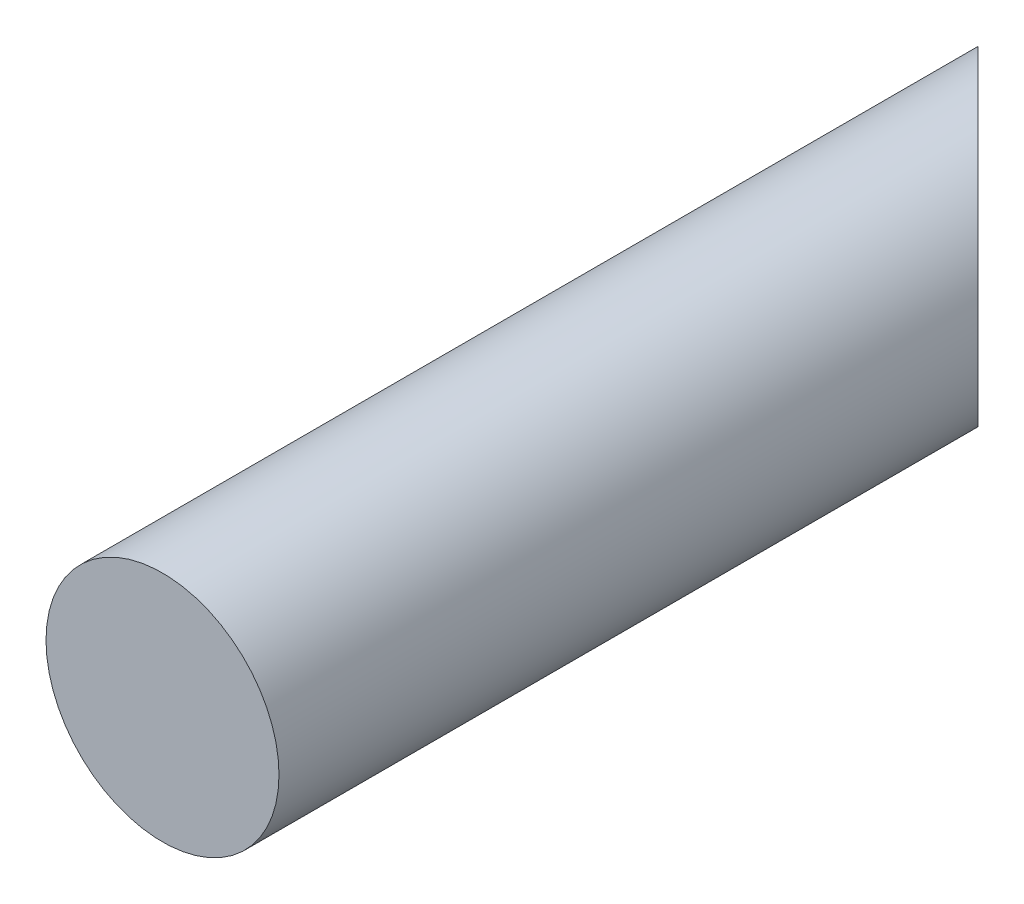
ISO-10303-21;
HEADER;
FILE_DESCRIPTION(('STEP AP214'),'2;1');
FILE_NAME('part.step','',(''),(''),'','','');
FILE_SCHEMA(('AUTOMOTIVE_DESIGN { 1 0 10303 214 1 1 1 1 }'));
ENDSEC;
DATA;
#1=APPLICATION_CONTEXT('core data for automotive mechanical design processes');
#2=APPLICATION_PROTOCOL_DEFINITION('international standard','automotive_design',2000,#1);
#3=PRODUCT_CONTEXT('',#1,'mechanical');
#4=PRODUCT('Part','Part','',(#3));
#5=PRODUCT_RELATED_PRODUCT_CATEGORY('part','',(#4));
#6=PRODUCT_DEFINITION_FORMATION('','',#4);
#7=PRODUCT_DEFINITION_CONTEXT('part definition',#1,'design');
#8=PRODUCT_DEFINITION('design','',#6,#7);
#9=PRODUCT_DEFINITION_SHAPE('','',#8);
#10=(LENGTH_UNIT() NAMED_UNIT(*) SI_UNIT(.MILLI.,.METRE.));
#11=(NAMED_UNIT(*) PLANE_ANGLE_UNIT() SI_UNIT($,.RADIAN.));
#12=(NAMED_UNIT(*) SI_UNIT($,.STERADIAN.) SOLID_ANGLE_UNIT());
#13=UNCERTAINTY_MEASURE_WITH_UNIT(LENGTH_MEASURE(1.E-05),#10,'distance_accuracy_value','');
#14=(GEOMETRIC_REPRESENTATION_CONTEXT(3) GLOBAL_UNCERTAINTY_ASSIGNED_CONTEXT((#13)) GLOBAL_UNIT_ASSIGNED_CONTEXT((#10,
#11,#12)) REPRESENTATION_CONTEXT('',''));
#15=CARTESIAN_POINT('',(0.,0.,0.));
#16=DIRECTION('',(0.,0.,1.));
#17=DIRECTION('',(1.,0.,0.));
#18=AXIS2_PLACEMENT_3D('',#15,#16,#17);
#19=CARTESIAN_POINT('',(0.,0.,240.));
#20=DIRECTION('',(0.,0.,-1.));
#21=DIRECTION('',(-1.,0.,0.));
#22=AXIS2_PLACEMENT_3D('',#19,#20,#21);
#23=CYLINDRICAL_SURFACE('',#22,30.);
#24=CARTESIAN_POINT('',(0.,0.,240.));
#25=DIRECTION('',(0.,0.,1.));
#26=DIRECTION('',(1.,0.,0.));
#27=AXIS2_PLACEMENT_3D('',#24,#25,#26);
#28=CIRCLE('',#27,30.);
#29=CARTESIAN_POINT('',(30.,0.,240.));
#30=VERTEX_POINT('',#29);
#31=EDGE_CURVE('E49',#30,#30,#28,.T.);
#32=ORIENTED_EDGE('',*,*,#31,.F.);
#33=EDGE_LOOP('',(#32));
#34=FACE_BOUND('',#33,.T.);
#35=CARTESIAN_POINT('',(0.,0.,30.));
#36=DIRECTION('',(-0.707106781186548,0.,0.707106781186548));
#37=DIRECTION('',(-0.707106781186548,0.,-0.707106781186548));
#38=AXIS2_PLACEMENT_3D('',#35,#36,#37);
#39=ELLIPSE('',#38,42.4264068711928,30.);
#40=CARTESIAN_POINT('',(-30.,0.,0.));
#41=VERTEX_POINT('',#40);
#42=EDGE_CURVE('E10',#41,#41,#39,.T.);
#43=ORIENTED_EDGE('',*,*,#42,.T.);
#44=EDGE_LOOP('',(#43));
#45=FACE_BOUND('',#44,.T.);
#46=ADVANCED_FACE('F43',(#34,#45),#23,.T.);
#47=CARTESIAN_POINT('',(0.,0.,240.));
#48=DIRECTION('',(0.,0.,1.));
#49=DIRECTION('',(1.,0.,0.));
#50=AXIS2_PLACEMENT_3D('',#47,#48,#49);
#51=PLANE('',#50);
#52=ORIENTED_EDGE('',*,*,#31,.T.);
#53=EDGE_LOOP('',(#52));
#54=FACE_BOUND('',#53,.T.);
#55=ADVANCED_FACE('F60',(#54),#51,.T.);
#56=CARTESIAN_POINT('',(-30.,-30.,0.));
#57=DIRECTION('',(-0.707106781186548,0.,0.707106781186548));
#58=DIRECTION('',(0.707106781186548,0.,0.707106781186548));
#59=AXIS2_PLACEMENT_3D('',#56,#57,#58);
#60=PLANE('',#59);
#61=ORIENTED_EDGE('',*,*,#42,.F.);
#62=EDGE_LOOP('',(#61));
#63=FACE_BOUND('',#62,.T.);
#64=ADVANCED_FACE('F61',(#63),#60,.F.);
#65=CLOSED_SHELL('',(#46,#55,#64));
#66=MANIFOLD_SOLID_BREP('B2',#65);
#67=ADVANCED_BREP_SHAPE_REPRESENTATION('',(#18,#66),#14);
#68=SHAPE_DEFINITION_REPRESENTATION(#9,#67);
ENDSEC;
END-ISO-10303-21;
